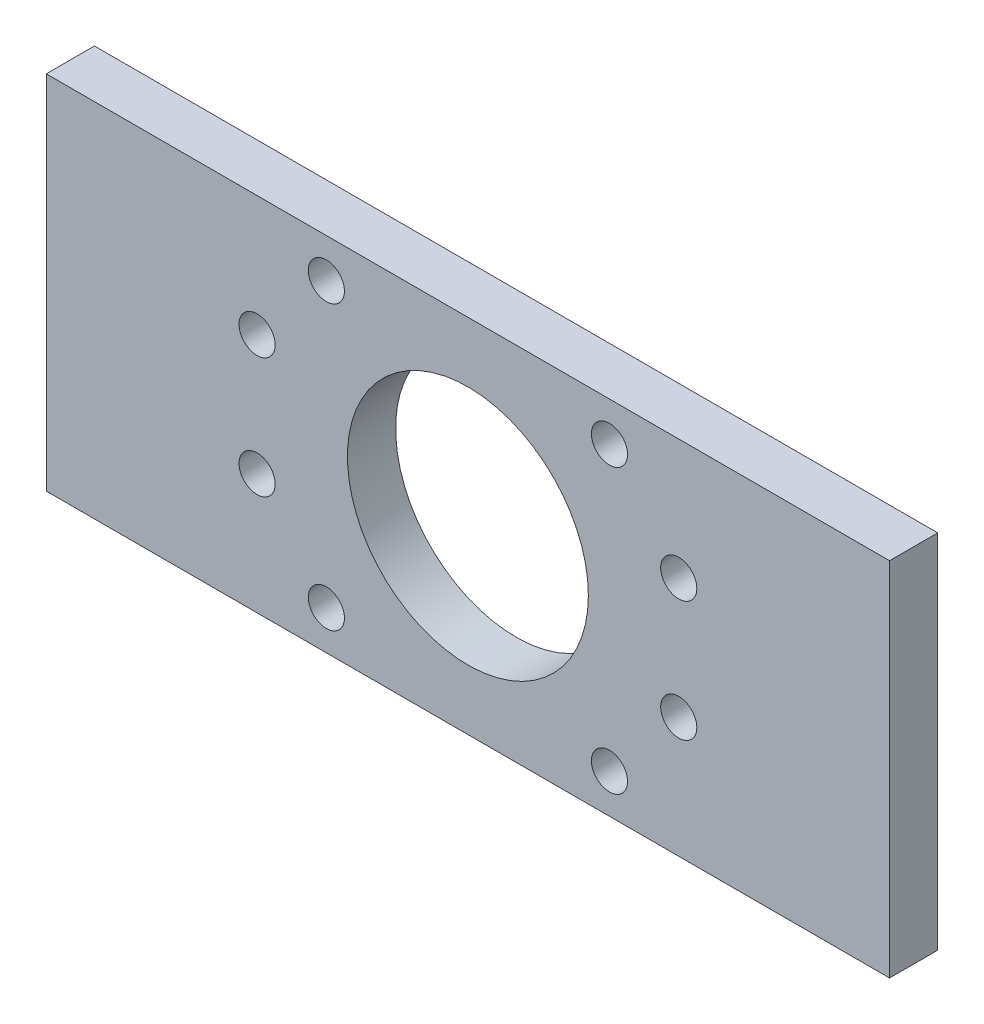
ISO-10303-21;
HEADER;
FILE_DESCRIPTION(('STEP AP214'),'2;1');
FILE_NAME('part.step','',(''),(''),'','','');
FILE_SCHEMA(('AUTOMOTIVE_DESIGN { 1 0 10303 214 1 1 1 1 }'));
ENDSEC;
DATA;
#1=APPLICATION_CONTEXT('core data for automotive mechanical design processes');
#2=APPLICATION_PROTOCOL_DEFINITION('international standard','automotive_design',2000,#1);
#3=PRODUCT_CONTEXT('',#1,'mechanical');
#4=PRODUCT('Part','Part','',(#3));
#5=PRODUCT_RELATED_PRODUCT_CATEGORY('part','',(#4));
#6=PRODUCT_DEFINITION_FORMATION('','',#4);
#7=PRODUCT_DEFINITION_CONTEXT('part definition',#1,'design');
#8=PRODUCT_DEFINITION('design','',#6,#7);
#9=PRODUCT_DEFINITION_SHAPE('','',#8);
#10=(LENGTH_UNIT() NAMED_UNIT(*) SI_UNIT(.MILLI.,.METRE.));
#11=(NAMED_UNIT(*) PLANE_ANGLE_UNIT() SI_UNIT($,.RADIAN.));
#12=(NAMED_UNIT(*) SI_UNIT($,.STERADIAN.) SOLID_ANGLE_UNIT());
#13=UNCERTAINTY_MEASURE_WITH_UNIT(LENGTH_MEASURE(1.E-05),#10,'distance_accuracy_value','');
#14=(GEOMETRIC_REPRESENTATION_CONTEXT(3) GLOBAL_UNCERTAINTY_ASSIGNED_CONTEXT((#13)) GLOBAL_UNIT_ASSIGNED_CONTEXT((#10,
#11,#12)) REPRESENTATION_CONTEXT('',''));
#15=CARTESIAN_POINT('',(0.,0.,0.));
#16=DIRECTION('',(0.,0.,1.));
#17=DIRECTION('',(1.,0.,0.));
#18=AXIS2_PLACEMENT_3D('',#15,#16,#17);
#19=CARTESIAN_POINT('',(-87.520553251037,42.1122994652407,8.));
#20=DIRECTION('',(1.,0.,0.));
#21=DIRECTION('',(0.,1.,0.));
#22=AXIS2_PLACEMENT_3D('',#19,#20,#21);
#23=PLANE('',#22);
#24=DIRECTION('',(0.,-1.,0.));
#25=VECTOR('',#24,1.);
#26=CARTESIAN_POINT('',(-87.520553251037,42.1122994652407,0.));
#27=LINE('',#26,#25);
#28=CARTESIAN_POINT('',(-87.520553251037,42.1122994652407,0.));
#29=VERTEX_POINT('',#28);
#30=CARTESIAN_POINT('',(-87.520553251037,-17.8877005347593,0.));
#31=VERTEX_POINT('',#30);
#32=EDGE_CURVE('E95',#29,#31,#27,.T.);
#33=ORIENTED_EDGE('',*,*,#32,.T.);
#34=DIRECTION('',(0.,0.,-1.));
#35=VECTOR('',#34,1.);
#36=CARTESIAN_POINT('',(-87.520553251037,-17.8877005347593,8.));
#37=LINE('',#36,#35);
#38=CARTESIAN_POINT('',(-87.520553251037,-17.8877005347593,8.));
#39=VERTEX_POINT('',#38);
#40=EDGE_CURVE('E11',#39,#31,#37,.T.);
#41=ORIENTED_EDGE('',*,*,#40,.F.);
#42=DIRECTION('',(0.,-1.,0.));
#43=VECTOR('',#42,1.);
#44=CARTESIAN_POINT('',(-87.520553251037,42.1122994652407,8.));
#45=LINE('',#44,#43);
#46=CARTESIAN_POINT('',(-87.520553251037,42.1122994652407,8.));
#47=VERTEX_POINT('',#46);
#48=EDGE_CURVE('E83',#47,#39,#45,.T.);
#49=ORIENTED_EDGE('',*,*,#48,.F.);
#50=DIRECTION('',(0.,0.,-1.));
#51=VECTOR('',#50,1.);
#52=CARTESIAN_POINT('',(-87.520553251037,42.1122994652407,8.));
#53=LINE('',#52,#51);
#54=EDGE_CURVE('E91',#47,#29,#53,.T.);
#55=ORIENTED_EDGE('',*,*,#54,.T.);
#56=EDGE_LOOP('',(#33,#41,#49,#55));
#57=FACE_BOUND('',#56,.T.);
#58=ADVANCED_FACE('F32',(#57),#23,.F.);
#59=CARTESIAN_POINT('',(-87.520553251037,-17.8877005347593,8.));
#60=DIRECTION('',(0.,1.,0.));
#61=DIRECTION('',(0.,0.,1.));
#62=AXIS2_PLACEMENT_3D('',#59,#60,#61);
#63=PLANE('',#62);
#64=DIRECTION('',(1.,0.,0.));
#65=VECTOR('',#64,1.);
#66=CARTESIAN_POINT('',(-87.520553251037,-17.8877005347593,0.));
#67=LINE('',#66,#65);
#68=CARTESIAN_POINT('',(52.479446748963,-17.8877005347593,0.));
#69=VERTEX_POINT('',#68);
#70=EDGE_CURVE('E87',#31,#69,#67,.T.);
#71=ORIENTED_EDGE('',*,*,#70,.T.);
#72=DIRECTION('',(0.,0.,-1.));
#73=VECTOR('',#72,1.);
#74=CARTESIAN_POINT('',(52.479446748963,-17.8877005347593,8.));
#75=LINE('',#74,#73);
#76=CARTESIAN_POINT('',(52.479446748963,-17.8877005347593,8.));
#77=VERTEX_POINT('',#76);
#78=EDGE_CURVE('E40',#77,#69,#75,.T.);
#79=ORIENTED_EDGE('',*,*,#78,.F.);
#80=DIRECTION('',(1.,0.,0.));
#81=VECTOR('',#80,1.);
#82=CARTESIAN_POINT('',(-87.520553251037,-17.8877005347593,8.));
#83=LINE('',#82,#81);
#84=EDGE_CURVE('E78',#39,#77,#83,.T.);
#85=ORIENTED_EDGE('',*,*,#84,.F.);
#86=ORIENTED_EDGE('',*,*,#40,.T.);
#87=EDGE_LOOP('',(#71,#79,#85,#86));
#88=FACE_BOUND('',#87,.T.);
#89=ADVANCED_FACE('F86',(#88),#63,.F.);
#90=CARTESIAN_POINT('',(52.479446748963,42.1122994652407,8.));
#91=DIRECTION('',(-1.,0.,0.));
#92=DIRECTION('',(0.,-1.,0.));
#93=AXIS2_PLACEMENT_3D('',#90,#91,#92);
#94=PLANE('',#93);
#95=DIRECTION('',(0.,1.,0.));
#96=VECTOR('',#95,1.);
#97=CARTESIAN_POINT('',(52.479446748963,42.1122994652407,0.));
#98=LINE('',#97,#96);
#99=CARTESIAN_POINT('',(52.479446748963,42.1122994652407,0.));
#100=VERTEX_POINT('',#99);
#101=EDGE_CURVE('E65',#69,#100,#98,.T.);
#102=ORIENTED_EDGE('',*,*,#101,.T.);
#103=DIRECTION('',(0.,0.,-1.));
#104=VECTOR('',#103,1.);
#105=CARTESIAN_POINT('',(52.479446748963,42.1122994652407,8.));
#106=LINE('',#105,#104);
#107=CARTESIAN_POINT('',(52.479446748963,42.1122994652407,8.));
#108=VERTEX_POINT('',#107);
#109=EDGE_CURVE('E88',#108,#100,#106,.T.);
#110=ORIENTED_EDGE('',*,*,#109,.F.);
#111=DIRECTION('',(0.,1.,0.));
#112=VECTOR('',#111,1.);
#113=CARTESIAN_POINT('',(52.479446748963,42.1122994652407,8.));
#114=LINE('',#113,#112);
#115=EDGE_CURVE('E81',#77,#108,#114,.T.);
#116=ORIENTED_EDGE('',*,*,#115,.F.);
#117=ORIENTED_EDGE('',*,*,#78,.T.);
#118=EDGE_LOOP('',(#102,#110,#116,#117));
#119=FACE_BOUND('',#118,.T.);
#120=ADVANCED_FACE('F89',(#119),#94,.F.);
#121=CARTESIAN_POINT('',(-87.520553251037,42.1122994652407,8.));
#122=DIRECTION('',(0.,-1.,0.));
#123=DIRECTION('',(0.,0.,-1.));
#124=AXIS2_PLACEMENT_3D('',#121,#122,#123);
#125=PLANE('',#124);
#126=DIRECTION('',(-1.,0.,0.));
#127=VECTOR('',#126,1.);
#128=CARTESIAN_POINT('',(-87.520553251037,42.1122994652407,0.));
#129=LINE('',#128,#127);
#130=EDGE_CURVE('E71',#100,#29,#129,.T.);
#131=ORIENTED_EDGE('',*,*,#130,.T.);
#132=ORIENTED_EDGE('',*,*,#54,.F.);
#133=DIRECTION('',(-1.,0.,0.));
#134=VECTOR('',#133,1.);
#135=CARTESIAN_POINT('',(-87.520553251037,42.1122994652407,8.));
#136=LINE('',#135,#134);
#137=EDGE_CURVE('E48',#108,#47,#136,.T.);
#138=ORIENTED_EDGE('',*,*,#137,.F.);
#139=ORIENTED_EDGE('',*,*,#109,.T.);
#140=EDGE_LOOP('',(#131,#132,#138,#139));
#141=FACE_BOUND('',#140,.T.);
#142=ADVANCED_FACE('F103',(#141),#125,.F.);
#143=CARTESIAN_POINT('',(0.,0.,8.));
#144=DIRECTION('',(0.,0.,1.));
#145=DIRECTION('',(1.,0.,0.));
#146=AXIS2_PLACEMENT_3D('',#143,#144,#145);
#147=PLANE('',#146);
#148=CARTESIAN_POINT('',(17.479446748963,2.11229946524066,8.));
#149=DIRECTION('',(0.,0.,1.));
#150=DIRECTION('',(1.,0.,0.));
#151=AXIS2_PLACEMENT_3D('',#148,#149,#150);
#152=CIRCLE('',#151,3.);
#153=CARTESIAN_POINT('',(20.479446748963,2.11229946524066,8.));
#154=VERTEX_POINT('',#153);
#155=EDGE_CURVE('E157',#154,#154,#152,.T.);
#156=ORIENTED_EDGE('',*,*,#155,.F.);
#157=EDGE_LOOP('',(#156));
#158=FACE_BOUND('',#157,.T.);
#159=CARTESIAN_POINT('',(17.479446748963,22.1122994652407,8.));
#160=DIRECTION('',(0.,0.,1.));
#161=DIRECTION('',(1.,0.,0.));
#162=AXIS2_PLACEMENT_3D('',#159,#160,#161);
#163=CIRCLE('',#162,3.);
#164=CARTESIAN_POINT('',(20.479446748963,22.1122994652407,8.));
#165=VERTEX_POINT('',#164);
#166=EDGE_CURVE('E151',#165,#165,#163,.T.);
#167=ORIENTED_EDGE('',*,*,#166,.F.);
#168=EDGE_LOOP('',(#167));
#169=FACE_BOUND('',#168,.T.);
#170=CARTESIAN_POINT('',(-52.520553251037,2.11229946524066,8.));
#171=DIRECTION('',(0.,0.,1.));
#172=DIRECTION('',(1.,0.,0.));
#173=AXIS2_PLACEMENT_3D('',#170,#171,#172);
#174=CIRCLE('',#173,3.);
#175=CARTESIAN_POINT('',(-49.520553251037,2.11229946524066,8.));
#176=VERTEX_POINT('',#175);
#177=EDGE_CURVE('E145',#176,#176,#174,.T.);
#178=ORIENTED_EDGE('',*,*,#177,.F.);
#179=EDGE_LOOP('',(#178));
#180=FACE_BOUND('',#179,.T.);
#181=CARTESIAN_POINT('',(-52.520553251037,22.1122994652407,8.));
#182=DIRECTION('',(0.,0.,1.));
#183=DIRECTION('',(1.,0.,0.));
#184=AXIS2_PLACEMENT_3D('',#181,#182,#183);
#185=CIRCLE('',#184,3.);
#186=CARTESIAN_POINT('',(-49.520553251037,22.1122994652407,8.));
#187=VERTEX_POINT('',#186);
#188=EDGE_CURVE('E139',#187,#187,#185,.T.);
#189=ORIENTED_EDGE('',*,*,#188,.F.);
#190=EDGE_LOOP('',(#189));
#191=FACE_BOUND('',#190,.T.);
#192=CARTESIAN_POINT('',(5.97944674896297,-11.3877005347593,8.));
#193=DIRECTION('',(0.,0.,1.));
#194=DIRECTION('',(1.,0.,0.));
#195=AXIS2_PLACEMENT_3D('',#192,#193,#194);
#196=CIRCLE('',#195,3.);
#197=CARTESIAN_POINT('',(8.97944674896297,-11.3877005347593,8.));
#198=VERTEX_POINT('',#197);
#199=EDGE_CURVE('E133',#198,#198,#196,.T.);
#200=ORIENTED_EDGE('',*,*,#199,.F.);
#201=EDGE_LOOP('',(#200));
#202=FACE_BOUND('',#201,.T.);
#203=CARTESIAN_POINT('',(5.97944674896297,35.6122994652407,8.));
#204=DIRECTION('',(0.,0.,1.));
#205=DIRECTION('',(1.,0.,0.));
#206=AXIS2_PLACEMENT_3D('',#203,#204,#205);
#207=CIRCLE('',#206,3.);
#208=CARTESIAN_POINT('',(8.97944674896298,35.6122994652407,8.));
#209=VERTEX_POINT('',#208);
#210=EDGE_CURVE('E127',#209,#209,#207,.T.);
#211=ORIENTED_EDGE('',*,*,#210,.F.);
#212=EDGE_LOOP('',(#211));
#213=FACE_BOUND('',#212,.T.);
#214=CARTESIAN_POINT('',(-41.020553251037,-11.3877005347593,8.));
#215=DIRECTION('',(0.,0.,1.));
#216=DIRECTION('',(1.,0.,0.));
#217=AXIS2_PLACEMENT_3D('',#214,#215,#216);
#218=CIRCLE('',#217,3.);
#219=CARTESIAN_POINT('',(-38.020553251037,-11.3877005347593,8.));
#220=VERTEX_POINT('',#219);
#221=EDGE_CURVE('E121',#220,#220,#218,.T.);
#222=ORIENTED_EDGE('',*,*,#221,.F.);
#223=EDGE_LOOP('',(#222));
#224=FACE_BOUND('',#223,.T.);
#225=CARTESIAN_POINT('',(-41.020553251037,35.6122994652407,8.));
#226=DIRECTION('',(0.,0.,1.));
#227=DIRECTION('',(1.,0.,0.));
#228=AXIS2_PLACEMENT_3D('',#225,#226,#227);
#229=CIRCLE('',#228,3.);
#230=CARTESIAN_POINT('',(-38.020553251037,35.6122994652407,8.));
#231=VERTEX_POINT('',#230);
#232=EDGE_CURVE('E115',#231,#231,#229,.T.);
#233=ORIENTED_EDGE('',*,*,#232,.F.);
#234=EDGE_LOOP('',(#233));
#235=FACE_BOUND('',#234,.T.);
#236=CARTESIAN_POINT('',(-17.520553251037,12.1122994652407,8.));
#237=DIRECTION('',(0.,0.,1.));
#238=DIRECTION('',(1.,0.,0.));
#239=AXIS2_PLACEMENT_3D('',#236,#237,#238);
#240=CIRCLE('',#239,20.);
#241=CARTESIAN_POINT('',(2.47944674896298,12.1122994652407,8.));
#242=VERTEX_POINT('',#241);
#243=EDGE_CURVE('E109',#242,#242,#240,.T.);
#244=ORIENTED_EDGE('',*,*,#243,.F.);
#245=EDGE_LOOP('',(#244));
#246=FACE_BOUND('',#245,.T.);
#247=ORIENTED_EDGE('',*,*,#48,.T.);
#248=ORIENTED_EDGE('',*,*,#84,.T.);
#249=ORIENTED_EDGE('',*,*,#115,.T.);
#250=ORIENTED_EDGE('',*,*,#137,.T.);
#251=EDGE_LOOP('',(#247,#248,#249,#250));
#252=FACE_BOUND('',#251,.T.);
#253=ADVANCED_FACE('F79',(#158,#169,#180,#191,#202,#213,#224,#235,#246,#252),#147,.T.);
#254=CARTESIAN_POINT('',(0.,0.,0.));
#255=DIRECTION('',(0.,0.,1.));
#256=DIRECTION('',(1.,0.,0.));
#257=AXIS2_PLACEMENT_3D('',#254,#255,#256);
#258=PLANE('',#257);
#259=CARTESIAN_POINT('',(17.479446748963,2.11229946524066,0.));
#260=DIRECTION('',(0.,0.,1.));
#261=DIRECTION('',(1.,0.,0.));
#262=AXIS2_PLACEMENT_3D('',#259,#260,#261);
#263=CIRCLE('',#262,3.);
#264=CARTESIAN_POINT('',(20.479446748963,2.11229946524066,0.));
#265=VERTEX_POINT('',#264);
#266=EDGE_CURVE('E154',#265,#265,#263,.T.);
#267=ORIENTED_EDGE('',*,*,#266,.T.);
#268=EDGE_LOOP('',(#267));
#269=FACE_BOUND('',#268,.T.);
#270=CARTESIAN_POINT('',(17.479446748963,22.1122994652407,0.));
#271=DIRECTION('',(0.,0.,1.));
#272=DIRECTION('',(1.,0.,0.));
#273=AXIS2_PLACEMENT_3D('',#270,#271,#272);
#274=CIRCLE('',#273,3.);
#275=CARTESIAN_POINT('',(20.479446748963,22.1122994652407,0.));
#276=VERTEX_POINT('',#275);
#277=EDGE_CURVE('E148',#276,#276,#274,.T.);
#278=ORIENTED_EDGE('',*,*,#277,.T.);
#279=EDGE_LOOP('',(#278));
#280=FACE_BOUND('',#279,.T.);
#281=CARTESIAN_POINT('',(-52.520553251037,2.11229946524066,0.));
#282=DIRECTION('',(0.,0.,1.));
#283=DIRECTION('',(1.,0.,0.));
#284=AXIS2_PLACEMENT_3D('',#281,#282,#283);
#285=CIRCLE('',#284,3.);
#286=CARTESIAN_POINT('',(-49.520553251037,2.11229946524066,0.));
#287=VERTEX_POINT('',#286);
#288=EDGE_CURVE('E142',#287,#287,#285,.T.);
#289=ORIENTED_EDGE('',*,*,#288,.T.);
#290=EDGE_LOOP('',(#289));
#291=FACE_BOUND('',#290,.T.);
#292=CARTESIAN_POINT('',(-52.520553251037,22.1122994652407,0.));
#293=DIRECTION('',(0.,0.,1.));
#294=DIRECTION('',(1.,0.,0.));
#295=AXIS2_PLACEMENT_3D('',#292,#293,#294);
#296=CIRCLE('',#295,3.);
#297=CARTESIAN_POINT('',(-49.520553251037,22.1122994652407,0.));
#298=VERTEX_POINT('',#297);
#299=EDGE_CURVE('E136',#298,#298,#296,.T.);
#300=ORIENTED_EDGE('',*,*,#299,.T.);
#301=EDGE_LOOP('',(#300));
#302=FACE_BOUND('',#301,.T.);
#303=CARTESIAN_POINT('',(5.97944674896297,-11.3877005347593,0.));
#304=DIRECTION('',(0.,0.,1.));
#305=DIRECTION('',(1.,0.,0.));
#306=AXIS2_PLACEMENT_3D('',#303,#304,#305);
#307=CIRCLE('',#306,3.);
#308=CARTESIAN_POINT('',(8.97944674896297,-11.3877005347593,0.));
#309=VERTEX_POINT('',#308);
#310=EDGE_CURVE('E130',#309,#309,#307,.T.);
#311=ORIENTED_EDGE('',*,*,#310,.T.);
#312=EDGE_LOOP('',(#311));
#313=FACE_BOUND('',#312,.T.);
#314=CARTESIAN_POINT('',(5.97944674896297,35.6122994652407,0.));
#315=DIRECTION('',(0.,0.,1.));
#316=DIRECTION('',(1.,0.,0.));
#317=AXIS2_PLACEMENT_3D('',#314,#315,#316);
#318=CIRCLE('',#317,3.);
#319=CARTESIAN_POINT('',(8.97944674896298,35.6122994652407,0.));
#320=VERTEX_POINT('',#319);
#321=EDGE_CURVE('E124',#320,#320,#318,.T.);
#322=ORIENTED_EDGE('',*,*,#321,.T.);
#323=EDGE_LOOP('',(#322));
#324=FACE_BOUND('',#323,.T.);
#325=CARTESIAN_POINT('',(-41.020553251037,-11.3877005347593,0.));
#326=DIRECTION('',(0.,0.,1.));
#327=DIRECTION('',(1.,0.,0.));
#328=AXIS2_PLACEMENT_3D('',#325,#326,#327);
#329=CIRCLE('',#328,3.);
#330=CARTESIAN_POINT('',(-38.020553251037,-11.3877005347593,0.));
#331=VERTEX_POINT('',#330);
#332=EDGE_CURVE('E118',#331,#331,#329,.T.);
#333=ORIENTED_EDGE('',*,*,#332,.T.);
#334=EDGE_LOOP('',(#333));
#335=FACE_BOUND('',#334,.T.);
#336=CARTESIAN_POINT('',(-41.020553251037,35.6122994652407,0.));
#337=DIRECTION('',(0.,0.,1.));
#338=DIRECTION('',(1.,0.,0.));
#339=AXIS2_PLACEMENT_3D('',#336,#337,#338);
#340=CIRCLE('',#339,3.);
#341=CARTESIAN_POINT('',(-38.020553251037,35.6122994652407,0.));
#342=VERTEX_POINT('',#341);
#343=EDGE_CURVE('E112',#342,#342,#340,.T.);
#344=ORIENTED_EDGE('',*,*,#343,.T.);
#345=EDGE_LOOP('',(#344));
#346=FACE_BOUND('',#345,.T.);
#347=CARTESIAN_POINT('',(-17.520553251037,12.1122994652407,0.));
#348=DIRECTION('',(0.,0.,1.));
#349=DIRECTION('',(1.,0.,0.));
#350=AXIS2_PLACEMENT_3D('',#347,#348,#349);
#351=CIRCLE('',#350,20.);
#352=CARTESIAN_POINT('',(2.47944674896298,12.1122994652407,0.));
#353=VERTEX_POINT('',#352);
#354=EDGE_CURVE('E98',#353,#353,#351,.T.);
#355=ORIENTED_EDGE('',*,*,#354,.T.);
#356=EDGE_LOOP('',(#355));
#357=FACE_BOUND('',#356,.T.);
#358=ORIENTED_EDGE('',*,*,#32,.F.);
#359=ORIENTED_EDGE('',*,*,#130,.F.);
#360=ORIENTED_EDGE('',*,*,#101,.F.);
#361=ORIENTED_EDGE('',*,*,#70,.F.);
#362=EDGE_LOOP('',(#358,#359,#360,#361));
#363=FACE_BOUND('',#362,.T.);
#364=ADVANCED_FACE('F106',(#269,#280,#291,#302,#313,#324,#335,#346,#357,#363),#258,.F.);
#365=CARTESIAN_POINT('',(-17.520553251037,12.1122994652407,0.));
#366=DIRECTION('',(0.,0.,1.));
#367=DIRECTION('',(1.,0.,0.));
#368=AXIS2_PLACEMENT_3D('',#365,#366,#367);
#369=CYLINDRICAL_SURFACE('',#368,20.);
#370=ORIENTED_EDGE('',*,*,#354,.F.);
#371=EDGE_LOOP('',(#370));
#372=FACE_BOUND('',#371,.T.);
#373=ORIENTED_EDGE('',*,*,#243,.T.);
#374=EDGE_LOOP('',(#373));
#375=FACE_BOUND('',#374,.T.);
#376=ADVANCED_FACE('F191',(#372,#375),#369,.F.);
#377=CARTESIAN_POINT('',(-41.020553251037,35.6122994652407,0.));
#378=DIRECTION('',(0.,0.,1.));
#379=DIRECTION('',(1.,0.,0.));
#380=AXIS2_PLACEMENT_3D('',#377,#378,#379);
#381=CYLINDRICAL_SURFACE('',#380,3.);
#382=ORIENTED_EDGE('',*,*,#343,.F.);
#383=EDGE_LOOP('',(#382));
#384=FACE_BOUND('',#383,.T.);
#385=ORIENTED_EDGE('',*,*,#232,.T.);
#386=EDGE_LOOP('',(#385));
#387=FACE_BOUND('',#386,.T.);
#388=ADVANCED_FACE('F193',(#384,#387),#381,.F.);
#389=CARTESIAN_POINT('',(-41.020553251037,-11.3877005347593,0.));
#390=DIRECTION('',(0.,0.,1.));
#391=DIRECTION('',(1.,0.,0.));
#392=AXIS2_PLACEMENT_3D('',#389,#390,#391);
#393=CYLINDRICAL_SURFACE('',#392,3.);
#394=ORIENTED_EDGE('',*,*,#332,.F.);
#395=EDGE_LOOP('',(#394));
#396=FACE_BOUND('',#395,.T.);
#397=ORIENTED_EDGE('',*,*,#221,.T.);
#398=EDGE_LOOP('',(#397));
#399=FACE_BOUND('',#398,.T.);
#400=ADVANCED_FACE('F200',(#396,#399),#393,.F.);
#401=CARTESIAN_POINT('',(5.97944674896297,35.6122994652407,0.));
#402=DIRECTION('',(0.,0.,1.));
#403=DIRECTION('',(1.,0.,0.));
#404=AXIS2_PLACEMENT_3D('',#401,#402,#403);
#405=CYLINDRICAL_SURFACE('',#404,3.);
#406=ORIENTED_EDGE('',*,*,#321,.F.);
#407=EDGE_LOOP('',(#406));
#408=FACE_BOUND('',#407,.T.);
#409=ORIENTED_EDGE('',*,*,#210,.T.);
#410=EDGE_LOOP('',(#409));
#411=FACE_BOUND('',#410,.T.);
#412=ADVANCED_FACE('F246',(#408,#411),#405,.F.);
#413=CARTESIAN_POINT('',(5.97944674896297,-11.3877005347593,0.));
#414=DIRECTION('',(0.,0.,1.));
#415=DIRECTION('',(1.,0.,0.));
#416=AXIS2_PLACEMENT_3D('',#413,#414,#415);
#417=CYLINDRICAL_SURFACE('',#416,3.);
#418=ORIENTED_EDGE('',*,*,#310,.F.);
#419=EDGE_LOOP('',(#418));
#420=FACE_BOUND('',#419,.T.);
#421=ORIENTED_EDGE('',*,*,#199,.T.);
#422=EDGE_LOOP('',(#421));
#423=FACE_BOUND('',#422,.T.);
#424=ADVANCED_FACE('F256',(#420,#423),#417,.F.);
#425=CARTESIAN_POINT('',(-52.520553251037,22.1122994652407,0.));
#426=DIRECTION('',(0.,0.,1.));
#427=DIRECTION('',(1.,0.,0.));
#428=AXIS2_PLACEMENT_3D('',#425,#426,#427);
#429=CYLINDRICAL_SURFACE('',#428,3.);
#430=ORIENTED_EDGE('',*,*,#299,.F.);
#431=EDGE_LOOP('',(#430));
#432=FACE_BOUND('',#431,.T.);
#433=ORIENTED_EDGE('',*,*,#188,.T.);
#434=EDGE_LOOP('',(#433));
#435=FACE_BOUND('',#434,.T.);
#436=ADVANCED_FACE('F266',(#432,#435),#429,.F.);
#437=CARTESIAN_POINT('',(-52.520553251037,2.11229946524066,0.));
#438=DIRECTION('',(0.,0.,1.));
#439=DIRECTION('',(1.,0.,0.));
#440=AXIS2_PLACEMENT_3D('',#437,#438,#439);
#441=CYLINDRICAL_SURFACE('',#440,3.);
#442=ORIENTED_EDGE('',*,*,#288,.F.);
#443=EDGE_LOOP('',(#442));
#444=FACE_BOUND('',#443,.T.);
#445=ORIENTED_EDGE('',*,*,#177,.T.);
#446=EDGE_LOOP('',(#445));
#447=FACE_BOUND('',#446,.T.);
#448=ADVANCED_FACE('F276',(#444,#447),#441,.F.);
#449=CARTESIAN_POINT('',(17.479446748963,22.1122994652407,0.));
#450=DIRECTION('',(0.,0.,1.));
#451=DIRECTION('',(1.,0.,0.));
#452=AXIS2_PLACEMENT_3D('',#449,#450,#451);
#453=CYLINDRICAL_SURFACE('',#452,3.);
#454=ORIENTED_EDGE('',*,*,#277,.F.);
#455=EDGE_LOOP('',(#454));
#456=FACE_BOUND('',#455,.T.);
#457=ORIENTED_EDGE('',*,*,#166,.T.);
#458=EDGE_LOOP('',(#457));
#459=FACE_BOUND('',#458,.T.);
#460=ADVANCED_FACE('F168',(#456,#459),#453,.F.);
#461=CARTESIAN_POINT('',(17.479446748963,2.11229946524066,0.));
#462=DIRECTION('',(0.,0.,1.));
#463=DIRECTION('',(1.,0.,0.));
#464=AXIS2_PLACEMENT_3D('',#461,#462,#463);
#465=CYLINDRICAL_SURFACE('',#464,3.);
#466=ORIENTED_EDGE('',*,*,#266,.F.);
#467=EDGE_LOOP('',(#466));
#468=FACE_BOUND('',#467,.T.);
#469=ORIENTED_EDGE('',*,*,#155,.T.);
#470=EDGE_LOOP('',(#469));
#471=FACE_BOUND('',#470,.T.);
#472=ADVANCED_FACE('F165',(#468,#471),#465,.F.);
#473=CLOSED_SHELL('',(#58,#89,#120,#142,#253,#364,#376,#388,#400,#412,#424,#436,#448,#460,#472));
#474=MANIFOLD_SOLID_BREP('B2',#473);
#475=ADVANCED_BREP_SHAPE_REPRESENTATION('',(#18,#474),#14);
#476=SHAPE_DEFINITION_REPRESENTATION(#9,#475);
ENDSEC;
END-ISO-10303-21;
